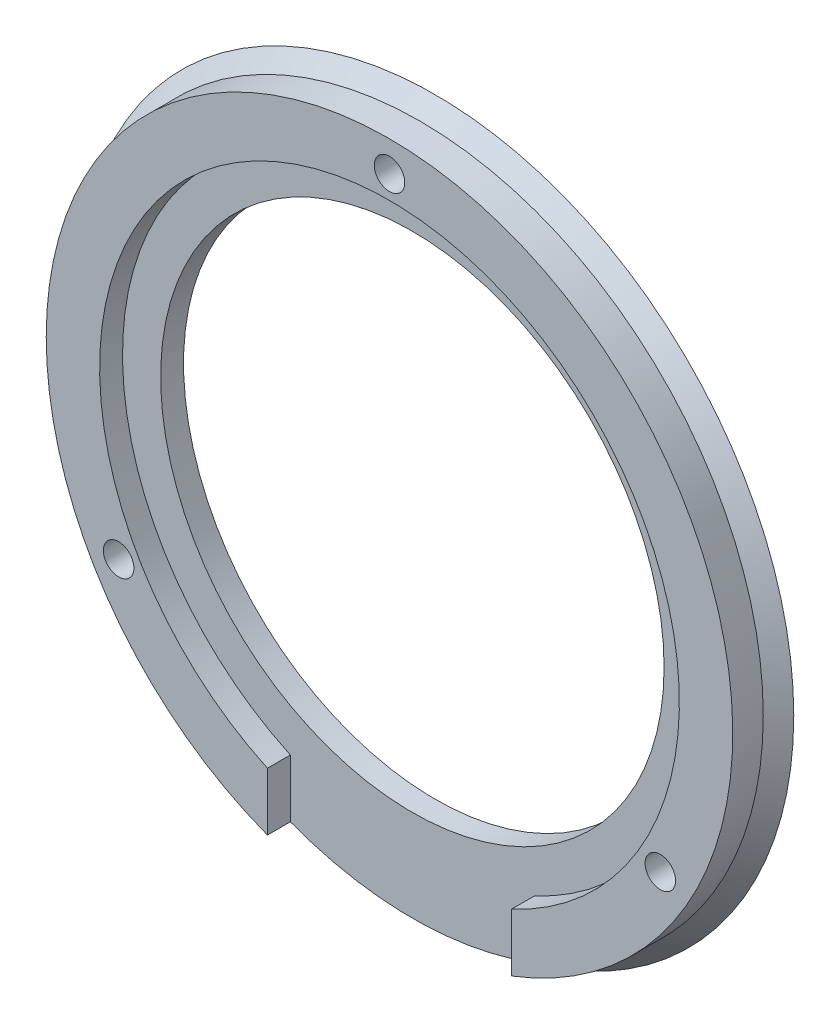
ISO-10303-21;
HEADER;
FILE_DESCRIPTION(('STEP AP214'),'2;1');
FILE_NAME('part.step','',(''),(''),'','','');
FILE_SCHEMA(('AUTOMOTIVE_DESIGN { 1 0 10303 214 1 1 1 1 }'));
ENDSEC;
DATA;
#1=APPLICATION_CONTEXT('core data for automotive mechanical design processes');
#2=APPLICATION_PROTOCOL_DEFINITION('international standard','automotive_design',2000,#1);
#3=PRODUCT_CONTEXT('',#1,'mechanical');
#4=PRODUCT('Part','Part','',(#3));
#5=PRODUCT_RELATED_PRODUCT_CATEGORY('part','',(#4));
#6=PRODUCT_DEFINITION_FORMATION('','',#4);
#7=PRODUCT_DEFINITION_CONTEXT('part definition',#1,'design');
#8=PRODUCT_DEFINITION('design','',#6,#7);
#9=PRODUCT_DEFINITION_SHAPE('','',#8);
#10=(LENGTH_UNIT() NAMED_UNIT(*) SI_UNIT(.MILLI.,.METRE.));
#11=(NAMED_UNIT(*) PLANE_ANGLE_UNIT() SI_UNIT($,.RADIAN.));
#12=(NAMED_UNIT(*) SI_UNIT($,.STERADIAN.) SOLID_ANGLE_UNIT());
#13=UNCERTAINTY_MEASURE_WITH_UNIT(LENGTH_MEASURE(1.E-05),#10,'distance_accuracy_value','');
#14=(GEOMETRIC_REPRESENTATION_CONTEXT(3) GLOBAL_UNCERTAINTY_ASSIGNED_CONTEXT((#13)) GLOBAL_UNIT_ASSIGNED_CONTEXT((#10,
#11,#12)) REPRESENTATION_CONTEXT('',''));
#15=CARTESIAN_POINT('',(0.,0.,0.));
#16=DIRECTION('',(0.,0.,1.));
#17=DIRECTION('',(1.,0.,0.));
#18=AXIS2_PLACEMENT_3D('',#15,#16,#17);
#19=CARTESIAN_POINT('',(0.,0.,3.));
#20=DIRECTION('',(0.,0.,1.));
#21=DIRECTION('',(1.,0.,0.));
#22=AXIS2_PLACEMENT_3D('',#19,#20,#21);
#23=PLANE('',#22);
#24=CARTESIAN_POINT('',(0.,20.5,3.));
#25=DIRECTION('',(0.,0.,1.));
#26=DIRECTION('',(1.,0.,0.));
#27=AXIS2_PLACEMENT_3D('',#24,#25,#26);
#28=CIRCLE('',#27,1.);
#29=CARTESIAN_POINT('',(1.,20.5,3.));
#30=VERTEX_POINT('',#29);
#31=EDGE_CURVE('E107',#30,#30,#28,.T.);
#32=ORIENTED_EDGE('',*,*,#31,.F.);
#33=EDGE_LOOP('',(#32));
#34=FACE_BOUND('',#33,.T.);
#35=CARTESIAN_POINT('',(17.7535207775819,-10.2499999999995,3.));
#36=DIRECTION('',(0.,0.,1.));
#37=DIRECTION('',(1.,0.,0.));
#38=AXIS2_PLACEMENT_3D('',#35,#36,#37);
#39=CIRCLE('',#38,1.00000000000079);
#40=CARTESIAN_POINT('',(18.7535207775827,-10.2499999999995,3.));
#41=VERTEX_POINT('',#40);
#42=EDGE_CURVE('E144',#41,#41,#39,.T.);
#43=ORIENTED_EDGE('',*,*,#42,.F.);
#44=EDGE_LOOP('',(#43));
#45=FACE_BOUND('',#44,.T.);
#46=CARTESIAN_POINT('',(-17.7535207775801,-10.2500000000005,3.));
#47=DIRECTION('',(0.,0.,1.));
#48=DIRECTION('',(1.,0.,0.));
#49=AXIS2_PLACEMENT_3D('',#46,#47,#48);
#50=CIRCLE('',#49,1.00000000000117);
#51=CARTESIAN_POINT('',(-16.753520777579,-10.2500000000005,3.));
#52=VERTEX_POINT('',#51);
#53=EDGE_CURVE('E103',#52,#52,#50,.T.);
#54=ORIENTED_EDGE('',*,*,#53,.F.);
#55=EDGE_LOOP('',(#54));
#56=FACE_BOUND('',#55,.T.);
#57=DIRECTION('',(0.,1.,0.));
#58=VECTOR('',#57,1.);
#59=CARTESIAN_POINT('',(8.,-29.9862375899879,3.));
#60=LINE('',#59,#58);
#61=CARTESIAN_POINT('',(8.,-21.0297408448131,3.));
#62=VERTEX_POINT('',#61);
#63=CARTESIAN_POINT('',(8.,-17.2336879396141,3.));
#64=VERTEX_POINT('',#63);
#65=EDGE_CURVE('E100',#62,#64,#60,.T.);
#66=ORIENTED_EDGE('',*,*,#65,.F.);
#67=CARTESIAN_POINT('',(0.,0.,3.));
#68=DIRECTION('',(0.,0.,1.));
#69=DIRECTION('',(1.,0.,0.));
#70=AXIS2_PLACEMENT_3D('',#67,#68,#69);
#71=CIRCLE('',#70,22.5);
#72=CARTESIAN_POINT('',(-8.,-21.0297408448131,3.));
#73=VERTEX_POINT('',#72);
#74=EDGE_CURVE('E53',#62,#73,#71,.T.);
#75=ORIENTED_EDGE('',*,*,#74,.T.);
#76=DIRECTION('',(0.,-1.,0.));
#77=VECTOR('',#76,1.);
#78=CARTESIAN_POINT('',(-8.,-6.37883407097592,3.));
#79=LINE('',#78,#77);
#80=CARTESIAN_POINT('',(-8.,-17.2336879396141,3.));
#81=VERTEX_POINT('',#80);
#82=EDGE_CURVE('E94',#81,#73,#79,.T.);
#83=ORIENTED_EDGE('',*,*,#82,.F.);
#84=CARTESIAN_POINT('',(0.,0.,3.));
#85=DIRECTION('',(0.,0.,1.));
#86=DIRECTION('',(1.,0.,0.));
#87=AXIS2_PLACEMENT_3D('',#84,#85,#86);
#88=CIRCLE('',#87,19.);
#89=EDGE_CURVE('E115',#64,#81,#88,.T.);
#90=ORIENTED_EDGE('',*,*,#89,.F.);
#91=EDGE_LOOP('',(#66,#75,#83,#90));
#92=FACE_BOUND('',#91,.T.);
#93=ADVANCED_FACE('F38',(#34,#45,#56,#92),#23,.T.);
#94=CARTESIAN_POINT('',(0.,0.,0.));
#95=DIRECTION('',(0.,0.,1.));
#96=DIRECTION('',(1.,0.,0.));
#97=AXIS2_PLACEMENT_3D('',#94,#95,#96);
#98=PLANE('',#97);
#99=CARTESIAN_POINT('',(0.,0.,0.));
#100=DIRECTION('',(0.,0.,1.));
#101=DIRECTION('',(1.,0.,0.));
#102=AXIS2_PLACEMENT_3D('',#99,#100,#101);
#103=CIRCLE('',#102,16.5);
#104=CARTESIAN_POINT('',(16.5,0.,0.));
#105=VERTEX_POINT('',#104);
#106=EDGE_CURVE('E47',#105,#105,#103,.T.);
#107=ORIENTED_EDGE('',*,*,#106,.T.);
#108=EDGE_LOOP('',(#107));
#109=FACE_BOUND('',#108,.T.);
#110=CARTESIAN_POINT('',(17.7535207775797,-10.2500000000008,0.));
#111=DIRECTION('',(0.,0.,-1.));
#112=DIRECTION('',(-1.,0.,0.));
#113=AXIS2_PLACEMENT_3D('',#110,#111,#112);
#114=CIRCLE('',#113,1.5);
#115=CARTESIAN_POINT('',(16.2535207775797,-10.2500000000008,0.));
#116=VERTEX_POINT('',#115);
#117=EDGE_CURVE('E155',#116,#116,#114,.T.);
#118=ORIENTED_EDGE('',*,*,#117,.F.);
#119=EDGE_LOOP('',(#118));
#120=FACE_BOUND('',#119,.T.);
#121=CARTESIAN_POINT('',(-17.7535207775823,-10.2499999999992,0.));
#122=DIRECTION('',(0.,0.,-1.));
#123=DIRECTION('',(-1.,0.,0.));
#124=AXIS2_PLACEMENT_3D('',#121,#122,#123);
#125=CIRCLE('',#124,1.5);
#126=CARTESIAN_POINT('',(-19.2535207775823,-10.2499999999992,0.));
#127=VERTEX_POINT('',#126);
#128=EDGE_CURVE('E164',#127,#127,#125,.T.);
#129=ORIENTED_EDGE('',*,*,#128,.F.);
#130=EDGE_LOOP('',(#129));
#131=FACE_BOUND('',#130,.T.);
#132=CARTESIAN_POINT('',(0.,20.5,0.));
#133=DIRECTION('',(0.,0.,-1.));
#134=DIRECTION('',(-1.,0.,0.));
#135=AXIS2_PLACEMENT_3D('',#132,#133,#134);
#136=CIRCLE('',#135,1.5);
#137=CARTESIAN_POINT('',(-1.5,20.5,0.));
#138=VERTEX_POINT('',#137);
#139=EDGE_CURVE('E172',#138,#138,#136,.T.);
#140=ORIENTED_EDGE('',*,*,#139,.F.);
#141=EDGE_LOOP('',(#140));
#142=FACE_BOUND('',#141,.T.);
#143=CARTESIAN_POINT('',(0.,0.,0.));
#144=DIRECTION('',(0.,0.,-1.));
#145=DIRECTION('',(-1.,0.,0.));
#146=AXIS2_PLACEMENT_3D('',#143,#144,#145);
#147=CIRCLE('',#146,23.5);
#148=CARTESIAN_POINT('',(-23.5,0.,0.));
#149=VERTEX_POINT('',#148);
#150=EDGE_CURVE('E186',#149,#149,#147,.T.);
#151=ORIENTED_EDGE('',*,*,#150,.T.);
#152=EDGE_LOOP('',(#151));
#153=FACE_BOUND('',#152,.T.);
#154=ADVANCED_FACE('F40',(#109,#120,#131,#142,#153),#98,.F.);
#155=CARTESIAN_POINT('',(0.,0.,1.5));
#156=DIRECTION('',(0.,0.,1.));
#157=DIRECTION('',(1.,0.,0.));
#158=AXIS2_PLACEMENT_3D('',#155,#156,#157);
#159=PLANE('',#158);
#160=CARTESIAN_POINT('',(0.,0.,1.5));
#161=DIRECTION('',(0.,0.,1.));
#162=DIRECTION('',(1.,0.,0.));
#163=AXIS2_PLACEMENT_3D('',#160,#161,#162);
#164=CIRCLE('',#163,16.5);
#165=CARTESIAN_POINT('',(16.5,0.,1.5));
#166=VERTEX_POINT('',#165);
#167=EDGE_CURVE('E119',#166,#166,#164,.T.);
#168=ORIENTED_EDGE('',*,*,#167,.F.);
#169=EDGE_LOOP('',(#168));
#170=FACE_BOUND('',#169,.T.);
#171=DIRECTION('',(0.,-1.,0.));
#172=VECTOR('',#171,1.);
#173=CARTESIAN_POINT('',(-8.,-6.37883407097592,1.5));
#174=LINE('',#173,#172);
#175=CARTESIAN_POINT('',(-8.,-17.2336879396141,1.5));
#176=VERTEX_POINT('',#175);
#177=CARTESIAN_POINT('',(-8.,-21.0297408448131,1.5));
#178=VERTEX_POINT('',#177);
#179=EDGE_CURVE('E85',#176,#178,#174,.T.);
#180=ORIENTED_EDGE('',*,*,#179,.T.);
#181=CARTESIAN_POINT('',(0.,0.,1.5));
#182=DIRECTION('',(0.,0.,1.));
#183=DIRECTION('',(1.,0.,0.));
#184=AXIS2_PLACEMENT_3D('',#181,#182,#183);
#185=CIRCLE('',#184,22.5);
#186=CARTESIAN_POINT('',(8.,-21.0297408448131,1.5));
#187=VERTEX_POINT('',#186);
#188=EDGE_CURVE('E79',#178,#187,#185,.T.);
#189=ORIENTED_EDGE('',*,*,#188,.T.);
#190=DIRECTION('',(0.,1.,0.));
#191=VECTOR('',#190,1.);
#192=CARTESIAN_POINT('',(8.,-29.9862375899879,1.5));
#193=LINE('',#192,#191);
#194=CARTESIAN_POINT('',(8.,-17.2336879396141,1.5));
#195=VERTEX_POINT('',#194);
#196=EDGE_CURVE('E61',#187,#195,#193,.T.);
#197=ORIENTED_EDGE('',*,*,#196,.T.);
#198=CARTESIAN_POINT('',(0.,0.,1.5));
#199=DIRECTION('',(0.,0.,1.));
#200=DIRECTION('',(1.,0.,0.));
#201=AXIS2_PLACEMENT_3D('',#198,#199,#200);
#202=CIRCLE('',#201,19.);
#203=EDGE_CURVE('E116',#195,#176,#202,.T.);
#204=ORIENTED_EDGE('',*,*,#203,.T.);
#205=EDGE_LOOP('',(#180,#189,#197,#204));
#206=FACE_BOUND('',#205,.T.);
#207=ADVANCED_FACE('F84',(#170,#206),#159,.T.);
#208=CARTESIAN_POINT('',(-8.,-6.37883407097592,1.5));
#209=DIRECTION('',(-1.,0.,0.));
#210=DIRECTION('',(0.,0.,1.));
#211=AXIS2_PLACEMENT_3D('',#208,#209,#210);
#212=PLANE('',#211);
#213=DIRECTION('',(0.,0.,-1.));
#214=VECTOR('',#213,1.);
#215=CARTESIAN_POINT('',(-8.,-21.0297408448131,0.));
#216=LINE('',#215,#214);
#217=EDGE_CURVE('E160',#178,#73,#216,.F.);
#218=ORIENTED_EDGE('',*,*,#217,.F.);
#219=ORIENTED_EDGE('',*,*,#179,.F.);
#220=DIRECTION('',(0.,0.,1.));
#221=VECTOR('',#220,1.);
#222=CARTESIAN_POINT('',(-8.,-17.2336879396141,1.5));
#223=LINE('',#222,#221);
#224=EDGE_CURVE('E111',#81,#176,#223,.F.);
#225=ORIENTED_EDGE('',*,*,#224,.F.);
#226=ORIENTED_EDGE('',*,*,#82,.T.);
#227=EDGE_LOOP('',(#218,#219,#225,#226));
#228=FACE_BOUND('',#227,.T.);
#229=ADVANCED_FACE('F229',(#228),#212,.F.);
#230=CARTESIAN_POINT('',(8.,-29.9862375899879,1.5));
#231=DIRECTION('',(1.,0.,0.));
#232=DIRECTION('',(0.,0.,-1.));
#233=AXIS2_PLACEMENT_3D('',#230,#231,#232);
#234=PLANE('',#233);
#235=DIRECTION('',(0.,0.,-1.));
#236=VECTOR('',#235,1.);
#237=CARTESIAN_POINT('',(8.,-21.0297408448131,0.));
#238=LINE('',#237,#236);
#239=EDGE_CURVE('E11',#62,#187,#238,.T.);
#240=ORIENTED_EDGE('',*,*,#239,.F.);
#241=ORIENTED_EDGE('',*,*,#65,.T.);
#242=DIRECTION('',(0.,0.,1.));
#243=VECTOR('',#242,1.);
#244=CARTESIAN_POINT('',(8.,-17.2336879396141,1.5));
#245=LINE('',#244,#243);
#246=EDGE_CURVE('E91',#195,#64,#245,.T.);
#247=ORIENTED_EDGE('',*,*,#246,.F.);
#248=ORIENTED_EDGE('',*,*,#196,.F.);
#249=EDGE_LOOP('',(#240,#241,#247,#248));
#250=FACE_BOUND('',#249,.T.);
#251=ADVANCED_FACE('F89',(#250),#234,.F.);
#252=CARTESIAN_POINT('',(-17.7535207775801,-10.2500000000005,-28.5));
#253=DIRECTION('',(0.,0.,1.));
#254=DIRECTION('',(1.,0.,0.));
#255=AXIS2_PLACEMENT_3D('',#252,#253,#254);
#256=CYLINDRICAL_SURFACE('',#255,1.00000000000117);
#257=ORIENTED_EDGE('',*,*,#53,.T.);
#258=EDGE_LOOP('',(#257));
#259=FACE_BOUND('',#258,.T.);
#260=CARTESIAN_POINT('',(-17.7535207775801,-10.2500000000005,1.));
#261=DIRECTION('',(0.,0.,-1.));
#262=DIRECTION('',(-1.,0.,0.));
#263=AXIS2_PLACEMENT_3D('',#260,#261,#262);
#264=CIRCLE('',#263,1.00000000000117);
#265=CARTESIAN_POINT('',(-18.7535207775813,-10.2500000000005,1.));
#266=VERTEX_POINT('',#265);
#267=EDGE_CURVE('E137',#266,#266,#264,.F.);
#268=ORIENTED_EDGE('',*,*,#267,.F.);
#269=EDGE_LOOP('',(#268));
#270=FACE_BOUND('',#269,.T.);
#271=ADVANCED_FACE('F233',(#259,#270),#256,.F.);
#272=CARTESIAN_POINT('',(17.7535207775819,-10.2499999999995,-28.5));
#273=DIRECTION('',(0.,0.,1.));
#274=DIRECTION('',(1.,0.,0.));
#275=AXIS2_PLACEMENT_3D('',#272,#273,#274);
#276=CYLINDRICAL_SURFACE('',#275,1.00000000000079);
#277=ORIENTED_EDGE('',*,*,#42,.T.);
#278=EDGE_LOOP('',(#277));
#279=FACE_BOUND('',#278,.T.);
#280=CARTESIAN_POINT('',(17.7535207775819,-10.2499999999995,1.));
#281=DIRECTION('',(0.,0.,-1.));
#282=DIRECTION('',(-1.,0.,0.));
#283=AXIS2_PLACEMENT_3D('',#280,#281,#282);
#284=CIRCLE('',#283,1.00000000000079);
#285=CARTESIAN_POINT('',(16.7535207775811,-10.2499999999995,1.));
#286=VERTEX_POINT('',#285);
#287=EDGE_CURVE('E133',#286,#286,#284,.F.);
#288=ORIENTED_EDGE('',*,*,#287,.F.);
#289=EDGE_LOOP('',(#288));
#290=FACE_BOUND('',#289,.T.);
#291=ADVANCED_FACE('F239',(#279,#290),#276,.F.);
#292=CARTESIAN_POINT('',(0.,20.5,-28.5));
#293=DIRECTION('',(0.,0.,1.));
#294=DIRECTION('',(1.,0.,0.));
#295=AXIS2_PLACEMENT_3D('',#292,#293,#294);
#296=CYLINDRICAL_SURFACE('',#295,1.);
#297=ORIENTED_EDGE('',*,*,#31,.T.);
#298=EDGE_LOOP('',(#297));
#299=FACE_BOUND('',#298,.T.);
#300=CARTESIAN_POINT('',(0.,20.5,1.));
#301=DIRECTION('',(0.,0.,-1.));
#302=DIRECTION('',(-1.,0.,0.));
#303=AXIS2_PLACEMENT_3D('',#300,#301,#302);
#304=CIRCLE('',#303,1.);
#305=CARTESIAN_POINT('',(-1.,20.5,1.));
#306=VERTEX_POINT('',#305);
#307=EDGE_CURVE('E129',#306,#306,#304,.F.);
#308=ORIENTED_EDGE('',*,*,#307,.F.);
#309=EDGE_LOOP('',(#308));
#310=FACE_BOUND('',#309,.T.);
#311=ADVANCED_FACE('F221',(#299,#310),#296,.F.);
#312=CARTESIAN_POINT('',(0.,0.,3.));
#313=DIRECTION('',(0.,0.,-1.));
#314=DIRECTION('',(-1.,0.,0.));
#315=AXIS2_PLACEMENT_3D('',#312,#313,#314);
#316=CYLINDRICAL_SURFACE('',#315,16.5);
#317=ORIENTED_EDGE('',*,*,#106,.F.);
#318=EDGE_LOOP('',(#317));
#319=FACE_BOUND('',#318,.T.);
#320=ORIENTED_EDGE('',*,*,#167,.T.);
#321=EDGE_LOOP('',(#320));
#322=FACE_BOUND('',#321,.T.);
#323=ADVANCED_FACE('F217',(#319,#322),#316,.F.);
#324=CARTESIAN_POINT('',(0.,0.,1.5));
#325=DIRECTION('',(0.,0.,1.));
#326=DIRECTION('',(1.,0.,0.));
#327=AXIS2_PLACEMENT_3D('',#324,#325,#326);
#328=CYLINDRICAL_SURFACE('',#327,19.);
#329=ORIENTED_EDGE('',*,*,#89,.T.);
#330=ORIENTED_EDGE('',*,*,#224,.T.);
#331=ORIENTED_EDGE('',*,*,#203,.F.);
#332=ORIENTED_EDGE('',*,*,#246,.T.);
#333=EDGE_LOOP('',(#329,#330,#331,#332));
#334=FACE_BOUND('',#333,.T.);
#335=ADVANCED_FACE('F220',(#334),#328,.F.);
#336=CARTESIAN_POINT('',(0.,20.5,1.));
#337=DIRECTION('',(0.,0.,-1.));
#338=DIRECTION('',(-1.,0.,0.));
#339=AXIS2_PLACEMENT_3D('',#336,#337,#338);
#340=PLANE('',#339);
#341=CARTESIAN_POINT('',(0.,20.5,1.));
#342=DIRECTION('',(0.,0.,-1.));
#343=DIRECTION('',(-1.,0.,0.));
#344=AXIS2_PLACEMENT_3D('',#341,#342,#343);
#345=CIRCLE('',#344,1.5);
#346=CARTESIAN_POINT('',(-1.5,20.5,1.));
#347=VERTEX_POINT('',#346);
#348=EDGE_CURVE('E134',#347,#347,#345,.T.);
#349=ORIENTED_EDGE('',*,*,#348,.T.);
#350=EDGE_LOOP('',(#349));
#351=FACE_BOUND('',#350,.T.);
#352=ORIENTED_EDGE('',*,*,#307,.T.);
#353=EDGE_LOOP('',(#352));
#354=FACE_BOUND('',#353,.T.);
#355=ADVANCED_FACE('F225',(#351,#354),#340,.T.);
#356=CARTESIAN_POINT('',(0.,20.5,1.));
#357=DIRECTION('',(0.,0.,-1.));
#358=DIRECTION('',(-1.,0.,0.));
#359=AXIS2_PLACEMENT_3D('',#356,#357,#358);
#360=CYLINDRICAL_SURFACE('',#359,1.5);
#361=ORIENTED_EDGE('',*,*,#348,.F.);
#362=EDGE_LOOP('',(#361));
#363=FACE_BOUND('',#362,.T.);
#364=ORIENTED_EDGE('',*,*,#139,.T.);
#365=EDGE_LOOP('',(#364));
#366=FACE_BOUND('',#365,.T.);
#367=ADVANCED_FACE('F251',(#363,#366),#360,.F.);
#368=CARTESIAN_POINT('',(17.7535207775797,-10.2500000000008,1.));
#369=DIRECTION('',(0.,0.,-1.));
#370=DIRECTION('',(-1.,0.,0.));
#371=AXIS2_PLACEMENT_3D('',#368,#369,#370);
#372=PLANE('',#371);
#373=CARTESIAN_POINT('',(17.7535207775797,-10.2500000000008,1.));
#374=DIRECTION('',(0.,0.,-1.));
#375=DIRECTION('',(-1.,0.,0.));
#376=AXIS2_PLACEMENT_3D('',#373,#374,#375);
#377=CIRCLE('',#376,1.5);
#378=CARTESIAN_POINT('',(16.2535207775797,-10.2500000000008,1.));
#379=VERTEX_POINT('',#378);
#380=EDGE_CURVE('E159',#379,#379,#377,.T.);
#381=ORIENTED_EDGE('',*,*,#380,.T.);
#382=EDGE_LOOP('',(#381));
#383=FACE_BOUND('',#382,.T.);
#384=ORIENTED_EDGE('',*,*,#287,.T.);
#385=EDGE_LOOP('',(#384));
#386=FACE_BOUND('',#385,.T.);
#387=ADVANCED_FACE('F248',(#383,#386),#372,.T.);
#388=CARTESIAN_POINT('',(17.7535207775797,-10.2500000000008,1.));
#389=DIRECTION('',(0.,0.,-1.));
#390=DIRECTION('',(-1.,0.,0.));
#391=AXIS2_PLACEMENT_3D('',#388,#389,#390);
#392=CYLINDRICAL_SURFACE('',#391,1.5);
#393=ORIENTED_EDGE('',*,*,#380,.F.);
#394=EDGE_LOOP('',(#393));
#395=FACE_BOUND('',#394,.T.);
#396=ORIENTED_EDGE('',*,*,#117,.T.);
#397=EDGE_LOOP('',(#396));
#398=FACE_BOUND('',#397,.T.);
#399=ADVANCED_FACE('F245',(#395,#398),#392,.F.);
#400=CARTESIAN_POINT('',(-17.7535207775823,-10.2499999999992,1.));
#401=DIRECTION('',(0.,0.,-1.));
#402=DIRECTION('',(-1.,0.,0.));
#403=AXIS2_PLACEMENT_3D('',#400,#401,#402);
#404=PLANE('',#403);
#405=CARTESIAN_POINT('',(-17.7535207775823,-10.2499999999992,1.));
#406=DIRECTION('',(0.,0.,-1.));
#407=DIRECTION('',(-1.,0.,0.));
#408=AXIS2_PLACEMENT_3D('',#405,#406,#407);
#409=CIRCLE('',#408,1.5);
#410=CARTESIAN_POINT('',(-19.2535207775823,-10.2499999999992,1.));
#411=VERTEX_POINT('',#410);
#412=EDGE_CURVE('E168',#411,#411,#409,.T.);
#413=ORIENTED_EDGE('',*,*,#412,.T.);
#414=EDGE_LOOP('',(#413));
#415=FACE_BOUND('',#414,.T.);
#416=ORIENTED_EDGE('',*,*,#267,.T.);
#417=EDGE_LOOP('',(#416));
#418=FACE_BOUND('',#417,.T.);
#419=ADVANCED_FACE('F204',(#415,#418),#404,.T.);
#420=CARTESIAN_POINT('',(-17.7535207775823,-10.2499999999992,1.));
#421=DIRECTION('',(0.,0.,-1.));
#422=DIRECTION('',(-1.,0.,0.));
#423=AXIS2_PLACEMENT_3D('',#420,#421,#422);
#424=CYLINDRICAL_SURFACE('',#423,1.5);
#425=ORIENTED_EDGE('',*,*,#412,.F.);
#426=EDGE_LOOP('',(#425));
#427=FACE_BOUND('',#426,.T.);
#428=ORIENTED_EDGE('',*,*,#128,.T.);
#429=EDGE_LOOP('',(#428));
#430=FACE_BOUND('',#429,.T.);
#431=ADVANCED_FACE('F199',(#427,#430),#424,.F.);
#432=CARTESIAN_POINT('',(0.,0.,0.));
#433=DIRECTION('',(0.,0.,-1.));
#434=DIRECTION('',(-1.,0.,0.));
#435=AXIS2_PLACEMENT_3D('',#432,#433,#434);
#436=CYLINDRICAL_SURFACE('',#435,22.5);
#437=CARTESIAN_POINT('',(0.,0.,1.));
#438=DIRECTION('',(0.,0.,-1.));
#439=DIRECTION('',(-1.,0.,0.));
#440=AXIS2_PLACEMENT_3D('',#437,#438,#439);
#441=CIRCLE('',#440,22.5);
#442=CARTESIAN_POINT('',(-22.5,0.,1.));
#443=VERTEX_POINT('',#442);
#444=EDGE_CURVE('E87',#443,#443,#441,.T.);
#445=ORIENTED_EDGE('',*,*,#444,.F.);
#446=EDGE_LOOP('',(#445));
#447=FACE_BOUND('',#446,.T.);
#448=ORIENTED_EDGE('',*,*,#217,.T.);
#449=ORIENTED_EDGE('',*,*,#74,.F.);
#450=ORIENTED_EDGE('',*,*,#239,.T.);
#451=ORIENTED_EDGE('',*,*,#188,.F.);
#452=EDGE_LOOP('',(#448,#449,#450,#451));
#453=FACE_BOUND('',#452,.T.);
#454=ADVANCED_FACE('F78',(#447,#453),#436,.T.);
#455=CARTESIAN_POINT('',(0.,0.,1.));
#456=DIRECTION('',(0.,0.,-1.));
#457=DIRECTION('',(-1.,0.,0.));
#458=AXIS2_PLACEMENT_3D('',#455,#456,#457);
#459=CONICAL_SURFACE('',#458,22.5,0.78539816339745);
#460=ORIENTED_EDGE('',*,*,#150,.F.);
#461=EDGE_LOOP('',(#460));
#462=FACE_BOUND('',#461,.T.);
#463=ORIENTED_EDGE('',*,*,#444,.T.);
#464=EDGE_LOOP('',(#463));
#465=FACE_BOUND('',#464,.T.);
#466=ADVANCED_FACE('F192',(#462,#465),#459,.T.);
#467=CLOSED_SHELL('',(#93,#154,#207,#229,#251,#271,#291,#311,#323,#335,#355,#367,#387,#399,#419,
#431,#454,#466));
#468=MANIFOLD_SOLID_BREP('B2',#467);
#469=ADVANCED_BREP_SHAPE_REPRESENTATION('',(#18,#468),#14);
#470=SHAPE_DEFINITION_REPRESENTATION(#9,#469);
ENDSEC;
END-ISO-10303-21;
